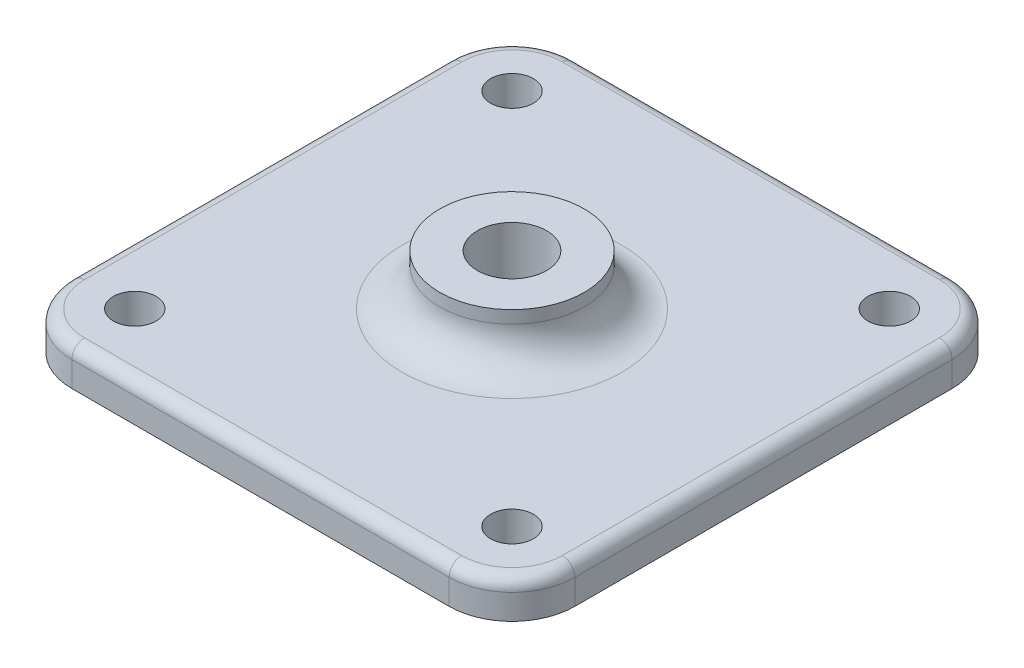
ISO-10303-21;
HEADER;
FILE_DESCRIPTION(('STEP AP214'),'2;1');
FILE_NAME('part.step','',(''),(''),'','','');
FILE_SCHEMA(('AUTOMOTIVE_DESIGN { 1 0 10303 214 1 1 1 1 }'));
ENDSEC;
DATA;
#1=APPLICATION_CONTEXT('core data for automotive mechanical design processes');
#2=APPLICATION_PROTOCOL_DEFINITION('international standard','automotive_design',2000,#1);
#3=PRODUCT_CONTEXT('',#1,'mechanical');
#4=PRODUCT('Part','Part','',(#3));
#5=PRODUCT_RELATED_PRODUCT_CATEGORY('part','',(#4));
#6=PRODUCT_DEFINITION_FORMATION('','',#4);
#7=PRODUCT_DEFINITION_CONTEXT('part definition',#1,'design');
#8=PRODUCT_DEFINITION('design','',#6,#7);
#9=PRODUCT_DEFINITION_SHAPE('','',#8);
#10=(LENGTH_UNIT() NAMED_UNIT(*) SI_UNIT(.MILLI.,.METRE.));
#11=(NAMED_UNIT(*) PLANE_ANGLE_UNIT() SI_UNIT($,.RADIAN.));
#12=(NAMED_UNIT(*) SI_UNIT($,.STERADIAN.) SOLID_ANGLE_UNIT());
#13=UNCERTAINTY_MEASURE_WITH_UNIT(LENGTH_MEASURE(1.E-05),#10,'distance_accuracy_value','');
#14=(GEOMETRIC_REPRESENTATION_CONTEXT(3) GLOBAL_UNCERTAINTY_ASSIGNED_CONTEXT((#13)) GLOBAL_UNIT_ASSIGNED_CONTEXT((#10,
#11,#12)) REPRESENTATION_CONTEXT('',''));
#15=CARTESIAN_POINT('',(0.,0.,0.));
#16=DIRECTION('',(0.,0.,1.));
#17=DIRECTION('',(1.,0.,0.));
#18=AXIS2_PLACEMENT_3D('',#15,#16,#17);
#19=CARTESIAN_POINT('',(0.,4.,0.));
#20=DIRECTION('',(0.,-1.,0.));
#21=DIRECTION('',(0.,0.,-1.));
#22=AXIS2_PLACEMENT_3D('',#19,#20,#21);
#23=CYLINDRICAL_SURFACE('',#22,2.75);
#24=CARTESIAN_POINT('',(0.,4.,0.));
#25=DIRECTION('',(0.,1.,0.));
#26=DIRECTION('',(0.,0.,1.));
#27=AXIS2_PLACEMENT_3D('',#24,#25,#26);
#28=CIRCLE('',#27,2.75);
#29=CARTESIAN_POINT('',(0.,4.,2.75));
#30=VERTEX_POINT('',#29);
#31=EDGE_CURVE('E195',#30,#30,#28,.T.);
#32=ORIENTED_EDGE('',*,*,#31,.T.);
#33=EDGE_LOOP('',(#32));
#34=FACE_BOUND('',#33,.T.);
#35=CARTESIAN_POINT('',(0.,-3.,0.));
#36=DIRECTION('',(0.,1.,0.));
#37=DIRECTION('',(0.,0.,1.));
#38=AXIS2_PLACEMENT_3D('',#35,#36,#37);
#39=CIRCLE('',#38,2.75);
#40=CARTESIAN_POINT('',(0.,-3.,2.75));
#41=VERTEX_POINT('',#40);
#42=EDGE_CURVE('E153',#41,#41,#39,.T.);
#43=ORIENTED_EDGE('',*,*,#42,.F.);
#44=EDGE_LOOP('',(#43));
#45=FACE_BOUND('',#44,.T.);
#46=ADVANCED_FACE('F35',(#34,#45),#23,.F.);
#47=CARTESIAN_POINT('',(0.,4.,0.));
#48=DIRECTION('',(0.,-1.,0.));
#49=DIRECTION('',(0.,0.,-1.));
#50=AXIS2_PLACEMENT_3D('',#47,#48,#49);
#51=CYLINDRICAL_SURFACE('',#50,5.75);
#52=CARTESIAN_POINT('',(0.,3.,0.));
#53=DIRECTION('',(0.,1.,0.));
#54=DIRECTION('',(0.,0.,1.));
#55=AXIS2_PLACEMENT_3D('',#52,#53,#54);
#56=CIRCLE('',#55,5.75);
#57=CARTESIAN_POINT('',(0.,3.,5.75));
#58=VERTEX_POINT('',#57);
#59=EDGE_CURVE('E215',#58,#58,#56,.T.);
#60=ORIENTED_EDGE('',*,*,#59,.T.);
#61=EDGE_LOOP('',(#60));
#62=FACE_BOUND('',#61,.T.);
#63=CARTESIAN_POINT('',(0.,4.,0.));
#64=DIRECTION('',(0.,1.,0.));
#65=DIRECTION('',(0.,0.,1.));
#66=AXIS2_PLACEMENT_3D('',#63,#64,#65);
#67=CIRCLE('',#66,5.75);
#68=CARTESIAN_POINT('',(0.,4.,5.75));
#69=VERTEX_POINT('',#68);
#70=EDGE_CURVE('E212',#69,#69,#67,.T.);
#71=ORIENTED_EDGE('',*,*,#70,.F.);
#72=EDGE_LOOP('',(#71));
#73=FACE_BOUND('',#72,.T.);
#74=ADVANCED_FACE('F325',(#62,#73),#51,.T.);
#75=CARTESIAN_POINT('',(0.,4.,0.));
#76=DIRECTION('',(0.,1.,0.));
#77=DIRECTION('',(0.,0.,1.));
#78=AXIS2_PLACEMENT_3D('',#75,#76,#77);
#79=PLANE('',#78);
#80=ORIENTED_EDGE('',*,*,#31,.F.);
#81=EDGE_LOOP('',(#80));
#82=FACE_BOUND('',#81,.T.);
#83=ORIENTED_EDGE('',*,*,#70,.T.);
#84=EDGE_LOOP('',(#83));
#85=FACE_BOUND('',#84,.T.);
#86=ADVANCED_FACE('F331',(#82,#85),#79,.T.);
#87=CARTESIAN_POINT('',(-15.,-3.,-15.));
#88=DIRECTION('',(0.,1.,0.));
#89=DIRECTION('',(0.,0.,1.));
#90=AXIS2_PLACEMENT_3D('',#87,#88,#89);
#91=CYLINDRICAL_SURFACE('',#90,5.);
#92=DIRECTION('',(0.,1.,0.));
#93=VECTOR('',#92,1.);
#94=CARTESIAN_POINT('',(-20.,-3.,-15.));
#95=LINE('',#94,#93);
#96=CARTESIAN_POINT('',(-20.,-3.,-15.));
#97=VERTEX_POINT('',#96);
#98=CARTESIAN_POINT('',(-20.,-1.,-15.));
#99=VERTEX_POINT('',#98);
#100=EDGE_CURVE('E141',#97,#99,#95,.T.);
#101=ORIENTED_EDGE('',*,*,#100,.T.);
#102=CARTESIAN_POINT('',(-15.,-1.,-15.));
#103=DIRECTION('',(0.,1.,0.));
#104=DIRECTION('',(0.,0.,1.));
#105=AXIS2_PLACEMENT_3D('',#102,#103,#104);
#106=CIRCLE('',#105,5.);
#107=CARTESIAN_POINT('',(-15.,-1.,-20.));
#108=VERTEX_POINT('',#107);
#109=EDGE_CURVE('E221',#99,#108,#106,.F.);
#110=ORIENTED_EDGE('',*,*,#109,.T.);
#111=DIRECTION('',(0.,1.,0.));
#112=VECTOR('',#111,1.);
#113=CARTESIAN_POINT('',(-15.,-3.,-20.));
#114=LINE('',#113,#112);
#115=CARTESIAN_POINT('',(-15.,-3.,-20.));
#116=VERTEX_POINT('',#115);
#117=EDGE_CURVE('E152',#116,#108,#114,.T.);
#118=ORIENTED_EDGE('',*,*,#117,.F.);
#119=CARTESIAN_POINT('',(-15.,-3.,-15.));
#120=DIRECTION('',(0.,1.,0.));
#121=DIRECTION('',(0.,0.,1.));
#122=AXIS2_PLACEMENT_3D('',#119,#120,#121);
#123=CIRCLE('',#122,5.);
#124=EDGE_CURVE('E131',#97,#116,#123,.F.);
#125=ORIENTED_EDGE('',*,*,#124,.F.);
#126=EDGE_LOOP('',(#101,#110,#118,#125));
#127=FACE_BOUND('',#126,.T.);
#128=ADVANCED_FACE('F151',(#127),#91,.T.);
#129=CARTESIAN_POINT('',(0.,-3.,-20.));
#130=DIRECTION('',(0.,0.,1.));
#131=DIRECTION('',(1.,0.,0.));
#132=AXIS2_PLACEMENT_3D('',#129,#130,#131);
#133=PLANE('',#132);
#134=ORIENTED_EDGE('',*,*,#117,.T.);
#135=DIRECTION('',(1.,0.,0.));
#136=VECTOR('',#135,1.);
#137=CARTESIAN_POINT('',(15.,-1.,-20.));
#138=LINE('',#137,#136);
#139=CARTESIAN_POINT('',(15.,-1.,-20.));
#140=VERTEX_POINT('',#139);
#141=EDGE_CURVE('E11',#108,#140,#138,.T.);
#142=ORIENTED_EDGE('',*,*,#141,.T.);
#143=DIRECTION('',(0.,1.,0.));
#144=VECTOR('',#143,1.);
#145=CARTESIAN_POINT('',(15.,-3.,-20.));
#146=LINE('',#145,#144);
#147=CARTESIAN_POINT('',(15.,-3.,-20.));
#148=VERTEX_POINT('',#147);
#149=EDGE_CURVE('E196',#148,#140,#146,.T.);
#150=ORIENTED_EDGE('',*,*,#149,.F.);
#151=DIRECTION('',(1.,0.,0.));
#152=VECTOR('',#151,1.);
#153=CARTESIAN_POINT('',(0.,-3.,-20.));
#154=LINE('',#153,#152);
#155=EDGE_CURVE('E170',#116,#148,#154,.T.);
#156=ORIENTED_EDGE('',*,*,#155,.F.);
#157=EDGE_LOOP('',(#134,#142,#150,#156));
#158=FACE_BOUND('',#157,.T.);
#159=ADVANCED_FACE('F298',(#158),#133,.F.);
#160=CARTESIAN_POINT('',(15.,-3.,-15.));
#161=DIRECTION('',(0.,1.,0.));
#162=DIRECTION('',(0.,0.,1.));
#163=AXIS2_PLACEMENT_3D('',#160,#161,#162);
#164=CYLINDRICAL_SURFACE('',#163,5.);
#165=ORIENTED_EDGE('',*,*,#149,.T.);
#166=CARTESIAN_POINT('',(15.,-1.,-15.));
#167=DIRECTION('',(0.,1.,0.));
#168=DIRECTION('',(0.,0.,1.));
#169=AXIS2_PLACEMENT_3D('',#166,#167,#168);
#170=CIRCLE('',#169,5.);
#171=CARTESIAN_POINT('',(20.,-1.,-15.));
#172=VERTEX_POINT('',#171);
#173=EDGE_CURVE('E44',#140,#172,#170,.F.);
#174=ORIENTED_EDGE('',*,*,#173,.T.);
#175=DIRECTION('',(0.,1.,0.));
#176=VECTOR('',#175,1.);
#177=CARTESIAN_POINT('',(20.,-3.,-15.));
#178=LINE('',#177,#176);
#179=CARTESIAN_POINT('',(20.,-3.,-15.));
#180=VERTEX_POINT('',#179);
#181=EDGE_CURVE('E198',#180,#172,#178,.T.);
#182=ORIENTED_EDGE('',*,*,#181,.F.);
#183=CARTESIAN_POINT('',(15.,-3.,-15.));
#184=DIRECTION('',(0.,1.,0.));
#185=DIRECTION('',(0.,0.,1.));
#186=AXIS2_PLACEMENT_3D('',#183,#184,#185);
#187=CIRCLE('',#186,5.);
#188=EDGE_CURVE('E168',#148,#180,#187,.F.);
#189=ORIENTED_EDGE('',*,*,#188,.F.);
#190=EDGE_LOOP('',(#165,#174,#182,#189));
#191=FACE_BOUND('',#190,.T.);
#192=ADVANCED_FACE('F301',(#191),#164,.T.);
#193=CARTESIAN_POINT('',(20.,-3.,0.));
#194=DIRECTION('',(1.,0.,0.));
#195=DIRECTION('',(0.,0.,-1.));
#196=AXIS2_PLACEMENT_3D('',#193,#194,#195);
#197=PLANE('',#196);
#198=ORIENTED_EDGE('',*,*,#181,.T.);
#199=DIRECTION('',(0.,0.,-1.));
#200=VECTOR('',#199,1.);
#201=CARTESIAN_POINT('',(20.,-1.,0.));
#202=LINE('',#201,#200);
#203=CARTESIAN_POINT('',(20.,-1.,15.));
#204=VERTEX_POINT('',#203);
#205=EDGE_CURVE('E247',#172,#204,#202,.F.);
#206=ORIENTED_EDGE('',*,*,#205,.T.);
#207=DIRECTION('',(0.,1.,0.));
#208=VECTOR('',#207,1.);
#209=CARTESIAN_POINT('',(20.,-3.,15.));
#210=LINE('',#209,#208);
#211=CARTESIAN_POINT('',(20.,-3.,15.));
#212=VERTEX_POINT('',#211);
#213=EDGE_CURVE('E200',#212,#204,#210,.T.);
#214=ORIENTED_EDGE('',*,*,#213,.F.);
#215=DIRECTION('',(0.,0.,-1.));
#216=VECTOR('',#215,1.);
#217=CARTESIAN_POINT('',(20.,-3.,0.));
#218=LINE('',#217,#216);
#219=EDGE_CURVE('E165',#212,#180,#218,.T.);
#220=ORIENTED_EDGE('',*,*,#219,.T.);
#221=EDGE_LOOP('',(#198,#206,#214,#220));
#222=FACE_BOUND('',#221,.T.);
#223=ADVANCED_FACE('F303',(#222),#197,.T.);
#224=CARTESIAN_POINT('',(15.,-3.,15.));
#225=DIRECTION('',(0.,1.,0.));
#226=DIRECTION('',(0.,0.,1.));
#227=AXIS2_PLACEMENT_3D('',#224,#225,#226);
#228=CYLINDRICAL_SURFACE('',#227,5.);
#229=ORIENTED_EDGE('',*,*,#213,.T.);
#230=CARTESIAN_POINT('',(15.,-1.,15.));
#231=DIRECTION('',(0.,1.,0.));
#232=DIRECTION('',(0.,0.,1.));
#233=AXIS2_PLACEMENT_3D('',#230,#231,#232);
#234=CIRCLE('',#233,5.);
#235=CARTESIAN_POINT('',(15.,-1.,20.));
#236=VERTEX_POINT('',#235);
#237=EDGE_CURVE('E245',#204,#236,#234,.F.);
#238=ORIENTED_EDGE('',*,*,#237,.T.);
#239=DIRECTION('',(0.,1.,0.));
#240=VECTOR('',#239,1.);
#241=CARTESIAN_POINT('',(15.,-3.,20.));
#242=LINE('',#241,#240);
#243=CARTESIAN_POINT('',(15.,-3.,20.));
#244=VERTEX_POINT('',#243);
#245=EDGE_CURVE('E203',#244,#236,#242,.T.);
#246=ORIENTED_EDGE('',*,*,#245,.F.);
#247=CARTESIAN_POINT('',(15.,-3.,15.));
#248=DIRECTION('',(0.,1.,0.));
#249=DIRECTION('',(0.,0.,1.));
#250=AXIS2_PLACEMENT_3D('',#247,#248,#249);
#251=CIRCLE('',#250,5.);
#252=EDGE_CURVE('E163',#212,#244,#251,.F.);
#253=ORIENTED_EDGE('',*,*,#252,.F.);
#254=EDGE_LOOP('',(#229,#238,#246,#253));
#255=FACE_BOUND('',#254,.T.);
#256=ADVANCED_FACE('F307',(#255),#228,.T.);
#257=CARTESIAN_POINT('',(0.,-3.,20.));
#258=DIRECTION('',(0.,0.,1.));
#259=DIRECTION('',(1.,0.,0.));
#260=AXIS2_PLACEMENT_3D('',#257,#258,#259);
#261=PLANE('',#260);
#262=ORIENTED_EDGE('',*,*,#245,.T.);
#263=DIRECTION('',(1.,0.,0.));
#264=VECTOR('',#263,1.);
#265=CARTESIAN_POINT('',(0.,-1.,20.));
#266=LINE('',#265,#264);
#267=CARTESIAN_POINT('',(-15.,-1.,20.));
#268=VERTEX_POINT('',#267);
#269=EDGE_CURVE('E243',#236,#268,#266,.F.);
#270=ORIENTED_EDGE('',*,*,#269,.T.);
#271=DIRECTION('',(0.,1.,0.));
#272=VECTOR('',#271,1.);
#273=CARTESIAN_POINT('',(-15.,-3.,20.));
#274=LINE('',#273,#272);
#275=CARTESIAN_POINT('',(-15.,-3.,20.));
#276=VERTEX_POINT('',#275);
#277=EDGE_CURVE('E206',#276,#268,#274,.T.);
#278=ORIENTED_EDGE('',*,*,#277,.F.);
#279=DIRECTION('',(1.,0.,0.));
#280=VECTOR('',#279,1.);
#281=CARTESIAN_POINT('',(0.,-3.,20.));
#282=LINE('',#281,#280);
#283=EDGE_CURVE('E160',#276,#244,#282,.T.);
#284=ORIENTED_EDGE('',*,*,#283,.T.);
#285=EDGE_LOOP('',(#262,#270,#278,#284));
#286=FACE_BOUND('',#285,.T.);
#287=ADVANCED_FACE('F309',(#286),#261,.T.);
#288=CARTESIAN_POINT('',(-15.,-3.,15.));
#289=DIRECTION('',(0.,1.,0.));
#290=DIRECTION('',(0.,0.,1.));
#291=AXIS2_PLACEMENT_3D('',#288,#289,#290);
#292=CYLINDRICAL_SURFACE('',#291,5.);
#293=ORIENTED_EDGE('',*,*,#277,.T.);
#294=CARTESIAN_POINT('',(-15.,-1.,15.));
#295=DIRECTION('',(0.,1.,0.));
#296=DIRECTION('',(0.,0.,1.));
#297=AXIS2_PLACEMENT_3D('',#294,#295,#296);
#298=CIRCLE('',#297,5.);
#299=CARTESIAN_POINT('',(-20.,-1.,15.));
#300=VERTEX_POINT('',#299);
#301=EDGE_CURVE('E241',#268,#300,#298,.F.);
#302=ORIENTED_EDGE('',*,*,#301,.T.);
#303=DIRECTION('',(0.,1.,0.));
#304=VECTOR('',#303,1.);
#305=CARTESIAN_POINT('',(-20.,-3.,15.));
#306=LINE('',#305,#304);
#307=CARTESIAN_POINT('',(-20.,-3.,15.));
#308=VERTEX_POINT('',#307);
#309=EDGE_CURVE('E148',#308,#300,#306,.T.);
#310=ORIENTED_EDGE('',*,*,#309,.F.);
#311=CARTESIAN_POINT('',(-15.,-3.,15.));
#312=DIRECTION('',(0.,1.,0.));
#313=DIRECTION('',(0.,0.,1.));
#314=AXIS2_PLACEMENT_3D('',#311,#312,#313);
#315=CIRCLE('',#314,5.);
#316=EDGE_CURVE('E135',#276,#308,#315,.F.);
#317=ORIENTED_EDGE('',*,*,#316,.F.);
#318=EDGE_LOOP('',(#293,#302,#310,#317));
#319=FACE_BOUND('',#318,.T.);
#320=ADVANCED_FACE('F311',(#319),#292,.T.);
#321=CARTESIAN_POINT('',(-15.,-3.,-15.));
#322=DIRECTION('',(0.,1.,0.));
#323=DIRECTION('',(0.,0.,1.));
#324=AXIS2_PLACEMENT_3D('',#321,#322,#323);
#325=CYLINDRICAL_SURFACE('',#324,1.7);
#326=CARTESIAN_POINT('',(-15.,-3.,-15.));
#327=DIRECTION('',(0.,1.,0.));
#328=DIRECTION('',(0.,0.,1.));
#329=AXIS2_PLACEMENT_3D('',#326,#327,#328);
#330=CIRCLE('',#329,1.7);
#331=CARTESIAN_POINT('',(-15.,-3.,-13.3));
#332=VERTEX_POINT('',#331);
#333=EDGE_CURVE('E178',#332,#332,#330,.T.);
#334=ORIENTED_EDGE('',*,*,#333,.F.);
#335=EDGE_LOOP('',(#334));
#336=FACE_BOUND('',#335,.T.);
#337=CARTESIAN_POINT('',(-15.,0.,-15.));
#338=DIRECTION('',(0.,1.,0.));
#339=DIRECTION('',(0.,0.,1.));
#340=AXIS2_PLACEMENT_3D('',#337,#338,#339);
#341=CIRCLE('',#340,1.7);
#342=CARTESIAN_POINT('',(-15.,0.,-13.3));
#343=VERTEX_POINT('',#342);
#344=EDGE_CURVE('E189',#343,#343,#341,.T.);
#345=ORIENTED_EDGE('',*,*,#344,.T.);
#346=EDGE_LOOP('',(#345));
#347=FACE_BOUND('',#346,.T.);
#348=ADVANCED_FACE('F313',(#336,#347),#325,.F.);
#349=CARTESIAN_POINT('',(15.,-3.,-15.));
#350=DIRECTION('',(0.,1.,0.));
#351=DIRECTION('',(0.,0.,1.));
#352=AXIS2_PLACEMENT_3D('',#349,#350,#351);
#353=CYLINDRICAL_SURFACE('',#352,1.7);
#354=CARTESIAN_POINT('',(15.,-3.,-15.));
#355=DIRECTION('',(0.,1.,0.));
#356=DIRECTION('',(0.,0.,1.));
#357=AXIS2_PLACEMENT_3D('',#354,#355,#356);
#358=CIRCLE('',#357,1.7);
#359=CARTESIAN_POINT('',(15.,-3.,-13.3));
#360=VERTEX_POINT('',#359);
#361=EDGE_CURVE('E175',#360,#360,#358,.T.);
#362=ORIENTED_EDGE('',*,*,#361,.F.);
#363=EDGE_LOOP('',(#362));
#364=FACE_BOUND('',#363,.T.);
#365=CARTESIAN_POINT('',(15.,0.,-15.));
#366=DIRECTION('',(0.,1.,0.));
#367=DIRECTION('',(0.,0.,1.));
#368=AXIS2_PLACEMENT_3D('',#365,#366,#367);
#369=CIRCLE('',#368,1.7);
#370=CARTESIAN_POINT('',(15.,0.,-13.3));
#371=VERTEX_POINT('',#370);
#372=EDGE_CURVE('E186',#371,#371,#369,.T.);
#373=ORIENTED_EDGE('',*,*,#372,.T.);
#374=EDGE_LOOP('',(#373));
#375=FACE_BOUND('',#374,.T.);
#376=ADVANCED_FACE('F319',(#364,#375),#353,.F.);
#377=CARTESIAN_POINT('',(15.,-3.,15.));
#378=DIRECTION('',(0.,1.,0.));
#379=DIRECTION('',(0.,0.,1.));
#380=AXIS2_PLACEMENT_3D('',#377,#378,#379);
#381=CYLINDRICAL_SURFACE('',#380,1.7);
#382=CARTESIAN_POINT('',(15.,-3.,15.));
#383=DIRECTION('',(0.,1.,0.));
#384=DIRECTION('',(0.,0.,1.));
#385=AXIS2_PLACEMENT_3D('',#382,#383,#384);
#386=CIRCLE('',#385,1.7);
#387=CARTESIAN_POINT('',(15.,-3.,16.7));
#388=VERTEX_POINT('',#387);
#389=EDGE_CURVE('E172',#388,#388,#386,.F.);
#390=ORIENTED_EDGE('',*,*,#389,.T.);
#391=EDGE_LOOP('',(#390));
#392=FACE_BOUND('',#391,.T.);
#393=CARTESIAN_POINT('',(15.,0.,15.));
#394=DIRECTION('',(0.,1.,0.));
#395=DIRECTION('',(0.,0.,1.));
#396=AXIS2_PLACEMENT_3D('',#393,#394,#395);
#397=CIRCLE('',#396,1.7);
#398=CARTESIAN_POINT('',(15.,0.,16.7));
#399=VERTEX_POINT('',#398);
#400=EDGE_CURVE('E183',#399,#399,#397,.F.);
#401=ORIENTED_EDGE('',*,*,#400,.F.);
#402=EDGE_LOOP('',(#401));
#403=FACE_BOUND('',#402,.T.);
#404=ADVANCED_FACE('F397',(#392,#403),#381,.F.);
#405=CARTESIAN_POINT('',(-20.,-3.,0.));
#406=DIRECTION('',(1.,0.,0.));
#407=DIRECTION('',(0.,0.,-1.));
#408=AXIS2_PLACEMENT_3D('',#405,#406,#407);
#409=PLANE('',#408);
#410=ORIENTED_EDGE('',*,*,#309,.T.);
#411=DIRECTION('',(0.,0.,-1.));
#412=VECTOR('',#411,1.);
#413=CARTESIAN_POINT('',(-20.,-1.,-15.));
#414=LINE('',#413,#412);
#415=EDGE_CURVE('E144',#300,#99,#414,.T.);
#416=ORIENTED_EDGE('',*,*,#415,.T.);
#417=ORIENTED_EDGE('',*,*,#100,.F.);
#418=DIRECTION('',(0.,0.,-1.));
#419=VECTOR('',#418,1.);
#420=CARTESIAN_POINT('',(-20.,-3.,0.));
#421=LINE('',#420,#419);
#422=EDGE_CURVE('E126',#308,#97,#421,.T.);
#423=ORIENTED_EDGE('',*,*,#422,.F.);
#424=EDGE_LOOP('',(#410,#416,#417,#423));
#425=FACE_BOUND('',#424,.T.);
#426=ADVANCED_FACE('F142',(#425),#409,.F.);
#427=CARTESIAN_POINT('',(-15.,-3.,15.));
#428=DIRECTION('',(0.,1.,0.));
#429=DIRECTION('',(0.,0.,1.));
#430=AXIS2_PLACEMENT_3D('',#427,#428,#429);
#431=CYLINDRICAL_SURFACE('',#430,1.7);
#432=CARTESIAN_POINT('',(-15.,-3.,15.));
#433=DIRECTION('',(0.,1.,0.));
#434=DIRECTION('',(0.,0.,1.));
#435=AXIS2_PLACEMENT_3D('',#432,#433,#434);
#436=CIRCLE('',#435,1.7);
#437=CARTESIAN_POINT('',(-15.,-3.,16.7));
#438=VERTEX_POINT('',#437);
#439=EDGE_CURVE('E149',#438,#438,#436,.F.);
#440=ORIENTED_EDGE('',*,*,#439,.T.);
#441=EDGE_LOOP('',(#440));
#442=FACE_BOUND('',#441,.T.);
#443=CARTESIAN_POINT('',(-15.,0.,15.));
#444=DIRECTION('',(0.,1.,0.));
#445=DIRECTION('',(0.,0.,1.));
#446=AXIS2_PLACEMENT_3D('',#443,#444,#445);
#447=CIRCLE('',#446,1.7);
#448=CARTESIAN_POINT('',(-15.,0.,16.7));
#449=VERTEX_POINT('',#448);
#450=EDGE_CURVE('E156',#449,#449,#447,.F.);
#451=ORIENTED_EDGE('',*,*,#450,.F.);
#452=EDGE_LOOP('',(#451));
#453=FACE_BOUND('',#452,.T.);
#454=ADVANCED_FACE('F382',(#442,#453),#431,.F.);
#455=CARTESIAN_POINT('',(0.,-3.,0.));
#456=DIRECTION('',(0.,1.,0.));
#457=DIRECTION('',(0.,0.,1.));
#458=AXIS2_PLACEMENT_3D('',#455,#456,#457);
#459=PLANE('',#458);
#460=ORIENTED_EDGE('',*,*,#42,.T.);
#461=EDGE_LOOP('',(#460));
#462=FACE_BOUND('',#461,.T.);
#463=ORIENTED_EDGE('',*,*,#124,.T.);
#464=ORIENTED_EDGE('',*,*,#155,.T.);
#465=ORIENTED_EDGE('',*,*,#188,.T.);
#466=ORIENTED_EDGE('',*,*,#219,.F.);
#467=ORIENTED_EDGE('',*,*,#252,.T.);
#468=ORIENTED_EDGE('',*,*,#283,.F.);
#469=ORIENTED_EDGE('',*,*,#316,.T.);
#470=ORIENTED_EDGE('',*,*,#422,.T.);
#471=EDGE_LOOP('',(#463,#464,#465,#466,#467,#468,#469,#470));
#472=FACE_BOUND('',#471,.T.);
#473=ORIENTED_EDGE('',*,*,#389,.F.);
#474=EDGE_LOOP('',(#473));
#475=FACE_BOUND('',#474,.T.);
#476=ORIENTED_EDGE('',*,*,#361,.T.);
#477=EDGE_LOOP('',(#476));
#478=FACE_BOUND('',#477,.T.);
#479=ORIENTED_EDGE('',*,*,#333,.T.);
#480=EDGE_LOOP('',(#479));
#481=FACE_BOUND('',#480,.T.);
#482=ORIENTED_EDGE('',*,*,#439,.F.);
#483=EDGE_LOOP('',(#482));
#484=FACE_BOUND('',#483,.T.);
#485=ADVANCED_FACE('F128',(#462,#472,#475,#478,#481,#484),#459,.F.);
#486=CARTESIAN_POINT('',(0.,0.,0.));
#487=DIRECTION('',(0.,1.,0.));
#488=DIRECTION('',(0.,0.,1.));
#489=AXIS2_PLACEMENT_3D('',#486,#487,#488);
#490=PLANE('',#489);
#491=DIRECTION('',(1.,0.,0.));
#492=VECTOR('',#491,1.);
#493=CARTESIAN_POINT('',(-15.,0.,-19.));
#494=LINE('',#493,#492);
#495=CARTESIAN_POINT('',(15.,0.,-19.));
#496=VERTEX_POINT('',#495);
#497=CARTESIAN_POINT('',(-15.,0.,-19.));
#498=VERTEX_POINT('',#497);
#499=EDGE_CURVE('E223',#496,#498,#494,.F.);
#500=ORIENTED_EDGE('',*,*,#499,.T.);
#501=CARTESIAN_POINT('',(-15.,0.,-15.));
#502=DIRECTION('',(0.,1.,0.));
#503=DIRECTION('',(0.,0.,1.));
#504=AXIS2_PLACEMENT_3D('',#501,#502,#503);
#505=CIRCLE('',#504,4.);
#506=CARTESIAN_POINT('',(-19.,0.,-15.));
#507=VERTEX_POINT('',#506);
#508=EDGE_CURVE('E237',#498,#507,#505,.T.);
#509=ORIENTED_EDGE('',*,*,#508,.T.);
#510=DIRECTION('',(0.,0.,-1.));
#511=VECTOR('',#510,1.);
#512=CARTESIAN_POINT('',(-19.,0.,15.));
#513=LINE('',#512,#511);
#514=CARTESIAN_POINT('',(-19.,0.,15.));
#515=VERTEX_POINT('',#514);
#516=EDGE_CURVE('E235',#507,#515,#513,.F.);
#517=ORIENTED_EDGE('',*,*,#516,.T.);
#518=CARTESIAN_POINT('',(-15.,0.,15.));
#519=DIRECTION('',(0.,1.,0.));
#520=DIRECTION('',(0.,0.,1.));
#521=AXIS2_PLACEMENT_3D('',#518,#519,#520);
#522=CIRCLE('',#521,4.);
#523=CARTESIAN_POINT('',(-15.,0.,19.));
#524=VERTEX_POINT('',#523);
#525=EDGE_CURVE('E233',#515,#524,#522,.T.);
#526=ORIENTED_EDGE('',*,*,#525,.T.);
#527=DIRECTION('',(1.,0.,0.));
#528=VECTOR('',#527,1.);
#529=CARTESIAN_POINT('',(0.,0.,19.));
#530=LINE('',#529,#528);
#531=CARTESIAN_POINT('',(15.,0.,19.));
#532=VERTEX_POINT('',#531);
#533=EDGE_CURVE('E231',#524,#532,#530,.T.);
#534=ORIENTED_EDGE('',*,*,#533,.T.);
#535=CARTESIAN_POINT('',(15.,0.,15.));
#536=DIRECTION('',(0.,1.,0.));
#537=DIRECTION('',(0.,0.,1.));
#538=AXIS2_PLACEMENT_3D('',#535,#536,#537);
#539=CIRCLE('',#538,4.);
#540=CARTESIAN_POINT('',(19.,0.,15.));
#541=VERTEX_POINT('',#540);
#542=EDGE_CURVE('E229',#532,#541,#539,.T.);
#543=ORIENTED_EDGE('',*,*,#542,.T.);
#544=DIRECTION('',(0.,0.,-1.));
#545=VECTOR('',#544,1.);
#546=CARTESIAN_POINT('',(19.,0.,0.));
#547=LINE('',#546,#545);
#548=CARTESIAN_POINT('',(19.,0.,-15.));
#549=VERTEX_POINT('',#548);
#550=EDGE_CURVE('E227',#541,#549,#547,.T.);
#551=ORIENTED_EDGE('',*,*,#550,.T.);
#552=CARTESIAN_POINT('',(15.,0.,-15.));
#553=DIRECTION('',(0.,1.,0.));
#554=DIRECTION('',(0.,0.,1.));
#555=AXIS2_PLACEMENT_3D('',#552,#553,#554);
#556=CIRCLE('',#555,4.);
#557=EDGE_CURVE('E225',#549,#496,#556,.T.);
#558=ORIENTED_EDGE('',*,*,#557,.T.);
#559=EDGE_LOOP('',(#500,#509,#517,#526,#534,#543,#551,#558));
#560=FACE_BOUND('',#559,.T.);
#561=CARTESIAN_POINT('',(0.,0.,0.));
#562=DIRECTION('',(0.,1.,0.));
#563=DIRECTION('',(0.,0.,1.));
#564=AXIS2_PLACEMENT_3D('',#561,#562,#563);
#565=CIRCLE('',#564,8.75);
#566=CARTESIAN_POINT('',(0.,0.,8.75));
#567=VERTEX_POINT('',#566);
#568=EDGE_CURVE('E218',#567,#567,#565,.F.);
#569=ORIENTED_EDGE('',*,*,#568,.T.);
#570=EDGE_LOOP('',(#569));
#571=FACE_BOUND('',#570,.T.);
#572=ORIENTED_EDGE('',*,*,#400,.T.);
#573=EDGE_LOOP('',(#572));
#574=FACE_BOUND('',#573,.T.);
#575=ORIENTED_EDGE('',*,*,#372,.F.);
#576=EDGE_LOOP('',(#575));
#577=FACE_BOUND('',#576,.T.);
#578=ORIENTED_EDGE('',*,*,#344,.F.);
#579=EDGE_LOOP('',(#578));
#580=FACE_BOUND('',#579,.T.);
#581=ORIENTED_EDGE('',*,*,#450,.T.);
#582=EDGE_LOOP('',(#581));
#583=FACE_BOUND('',#582,.T.);
#584=ADVANCED_FACE('F282',(#560,#571,#574,#577,#580,#583),#490,.T.);
#585=CARTESIAN_POINT('',(0.,3.,0.));
#586=DIRECTION('',(0.,1.,0.));
#587=DIRECTION('',(0.,0.,1.));
#588=AXIS2_PLACEMENT_3D('',#585,#586,#587);
#589=TOROIDAL_SURFACE('',#588,8.75,3.);
#590=ORIENTED_EDGE('',*,*,#568,.F.);
#591=EDGE_LOOP('',(#590));
#592=FACE_BOUND('',#591,.T.);
#593=ORIENTED_EDGE('',*,*,#59,.F.);
#594=EDGE_LOOP('',(#593));
#595=FACE_BOUND('',#594,.T.);
#596=ADVANCED_FACE('F337',(#592,#595),#589,.F.);
#597=CARTESIAN_POINT('',(15.,-1.,15.));
#598=DIRECTION('',(0.,1.,0.));
#599=DIRECTION('',(0.,0.,1.));
#600=AXIS2_PLACEMENT_3D('',#597,#598,#599);
#601=TOROIDAL_SURFACE('',#600,4.,1.);
#602=CARTESIAN_POINT('',(19.,-1.,15.));
#603=DIRECTION('',(0.,0.,-1.));
#604=DIRECTION('',(-1.,0.,0.));
#605=AXIS2_PLACEMENT_3D('',#602,#603,#604);
#606=CIRCLE('',#605,1.);
#607=EDGE_CURVE('E265',#541,#204,#606,.T.);
#608=ORIENTED_EDGE('',*,*,#607,.F.);
#609=ORIENTED_EDGE('',*,*,#542,.F.);
#610=CARTESIAN_POINT('',(15.,-1.,19.));
#611=DIRECTION('',(-1.,0.,0.));
#612=DIRECTION('',(0.,-1.,0.));
#613=AXIS2_PLACEMENT_3D('',#610,#611,#612);
#614=CIRCLE('',#613,1.);
#615=EDGE_CURVE('E39',#236,#532,#614,.T.);
#616=ORIENTED_EDGE('',*,*,#615,.F.);
#617=ORIENTED_EDGE('',*,*,#237,.F.);
#618=EDGE_LOOP('',(#608,#609,#616,#617));
#619=FACE_BOUND('',#618,.T.);
#620=ADVANCED_FACE('F37',(#619),#601,.T.);
#621=CARTESIAN_POINT('',(0.,-1.,19.));
#622=DIRECTION('',(1.,0.,0.));
#623=DIRECTION('',(0.,0.,-1.));
#624=AXIS2_PLACEMENT_3D('',#621,#622,#623);
#625=CYLINDRICAL_SURFACE('',#624,1.);
#626=ORIENTED_EDGE('',*,*,#615,.T.);
#627=ORIENTED_EDGE('',*,*,#533,.F.);
#628=CARTESIAN_POINT('',(-15.,-1.,19.));
#629=DIRECTION('',(-1.,0.,0.));
#630=DIRECTION('',(0.,-1.,0.));
#631=AXIS2_PLACEMENT_3D('',#628,#629,#630);
#632=CIRCLE('',#631,1.);
#633=EDGE_CURVE('E263',#268,#524,#632,.T.);
#634=ORIENTED_EDGE('',*,*,#633,.F.);
#635=ORIENTED_EDGE('',*,*,#269,.F.);
#636=EDGE_LOOP('',(#626,#627,#634,#635));
#637=FACE_BOUND('',#636,.T.);
#638=ADVANCED_FACE('F276',(#637),#625,.T.);
#639=CARTESIAN_POINT('',(19.,-1.,0.));
#640=DIRECTION('',(0.,0.,-1.));
#641=DIRECTION('',(-1.,0.,0.));
#642=AXIS2_PLACEMENT_3D('',#639,#640,#641);
#643=CYLINDRICAL_SURFACE('',#642,1.);
#644=ORIENTED_EDGE('',*,*,#607,.T.);
#645=ORIENTED_EDGE('',*,*,#205,.F.);
#646=CARTESIAN_POINT('',(19.,-1.,-15.));
#647=DIRECTION('',(0.,0.,-1.));
#648=DIRECTION('',(-1.,0.,0.));
#649=AXIS2_PLACEMENT_3D('',#646,#647,#648);
#650=CIRCLE('',#649,1.);
#651=EDGE_CURVE('E260',#549,#172,#650,.T.);
#652=ORIENTED_EDGE('',*,*,#651,.F.);
#653=ORIENTED_EDGE('',*,*,#550,.F.);
#654=EDGE_LOOP('',(#644,#645,#652,#653));
#655=FACE_BOUND('',#654,.T.);
#656=ADVANCED_FACE('F355',(#655),#643,.T.);
#657=CARTESIAN_POINT('',(-15.,-1.,15.));
#658=DIRECTION('',(0.,1.,0.));
#659=DIRECTION('',(0.,0.,1.));
#660=AXIS2_PLACEMENT_3D('',#657,#658,#659);
#661=TOROIDAL_SURFACE('',#660,4.,1.);
#662=ORIENTED_EDGE('',*,*,#633,.T.);
#663=ORIENTED_EDGE('',*,*,#525,.F.);
#664=CARTESIAN_POINT('',(-19.,-1.,15.));
#665=DIRECTION('',(0.,0.,-1.));
#666=DIRECTION('',(0.,1.,0.));
#667=AXIS2_PLACEMENT_3D('',#664,#665,#666);
#668=CIRCLE('',#667,1.);
#669=EDGE_CURVE('E257',#300,#515,#668,.T.);
#670=ORIENTED_EDGE('',*,*,#669,.F.);
#671=ORIENTED_EDGE('',*,*,#301,.F.);
#672=EDGE_LOOP('',(#662,#663,#670,#671));
#673=FACE_BOUND('',#672,.T.);
#674=ADVANCED_FACE('F289',(#673),#661,.T.);
#675=CARTESIAN_POINT('',(15.,-1.,-15.));
#676=DIRECTION('',(0.,1.,0.));
#677=DIRECTION('',(0.,0.,1.));
#678=AXIS2_PLACEMENT_3D('',#675,#676,#677);
#679=TOROIDAL_SURFACE('',#678,4.,1.);
#680=ORIENTED_EDGE('',*,*,#651,.T.);
#681=ORIENTED_EDGE('',*,*,#173,.F.);
#682=CARTESIAN_POINT('',(15.,-1.,-19.));
#683=DIRECTION('',(-1.,0.,0.));
#684=DIRECTION('',(0.,0.,1.));
#685=AXIS2_PLACEMENT_3D('',#682,#683,#684);
#686=CIRCLE('',#685,1.);
#687=EDGE_CURVE('E254',#496,#140,#686,.T.);
#688=ORIENTED_EDGE('',*,*,#687,.F.);
#689=ORIENTED_EDGE('',*,*,#557,.F.);
#690=EDGE_LOOP('',(#680,#681,#688,#689));
#691=FACE_BOUND('',#690,.T.);
#692=ADVANCED_FACE('F349',(#691),#679,.T.);
#693=CARTESIAN_POINT('',(-19.,-1.,0.));
#694=DIRECTION('',(0.,0.,1.));
#695=DIRECTION('',(1.,0.,0.));
#696=AXIS2_PLACEMENT_3D('',#693,#694,#695);
#697=CYLINDRICAL_SURFACE('',#696,1.);
#698=ORIENTED_EDGE('',*,*,#669,.T.);
#699=ORIENTED_EDGE('',*,*,#516,.F.);
#700=CARTESIAN_POINT('',(-19.,-1.,-15.));
#701=DIRECTION('',(0.,0.,-1.));
#702=DIRECTION('',(0.,1.,0.));
#703=AXIS2_PLACEMENT_3D('',#700,#701,#702);
#704=CIRCLE('',#703,1.);
#705=EDGE_CURVE('E252',#99,#507,#704,.T.);
#706=ORIENTED_EDGE('',*,*,#705,.F.);
#707=ORIENTED_EDGE('',*,*,#415,.F.);
#708=EDGE_LOOP('',(#698,#699,#706,#707));
#709=FACE_BOUND('',#708,.T.);
#710=ADVANCED_FACE('F292',(#709),#697,.T.);
#711=CARTESIAN_POINT('',(0.,-1.,-19.));
#712=DIRECTION('',(-1.,0.,0.));
#713=DIRECTION('',(0.,0.,1.));
#714=AXIS2_PLACEMENT_3D('',#711,#712,#713);
#715=CYLINDRICAL_SURFACE('',#714,1.);
#716=ORIENTED_EDGE('',*,*,#687,.T.);
#717=ORIENTED_EDGE('',*,*,#141,.F.);
#718=CARTESIAN_POINT('',(-15.,-1.,-19.));
#719=DIRECTION('',(-1.,0.,0.));
#720=DIRECTION('',(0.,0.,1.));
#721=AXIS2_PLACEMENT_3D('',#718,#719,#720);
#722=CIRCLE('',#721,1.);
#723=EDGE_CURVE('E250',#498,#108,#722,.T.);
#724=ORIENTED_EDGE('',*,*,#723,.F.);
#725=ORIENTED_EDGE('',*,*,#499,.F.);
#726=EDGE_LOOP('',(#716,#717,#724,#725));
#727=FACE_BOUND('',#726,.T.);
#728=ADVANCED_FACE('F343',(#727),#715,.T.);
#729=CARTESIAN_POINT('',(-15.,-1.,-15.));
#730=DIRECTION('',(0.,1.,0.));
#731=DIRECTION('',(0.,0.,1.));
#732=AXIS2_PLACEMENT_3D('',#729,#730,#731);
#733=TOROIDAL_SURFACE('',#732,4.,1.);
#734=ORIENTED_EDGE('',*,*,#705,.T.);
#735=ORIENTED_EDGE('',*,*,#508,.F.);
#736=ORIENTED_EDGE('',*,*,#723,.T.);
#737=ORIENTED_EDGE('',*,*,#109,.F.);
#738=EDGE_LOOP('',(#734,#735,#736,#737));
#739=FACE_BOUND('',#738,.T.);
#740=ADVANCED_FACE('F296',(#739),#733,.T.);
#741=CLOSED_SHELL('',(#46,#74,#86,#128,#159,#192,#223,#256,#287,#320,#348,#376,#404,#426,#454,
#485,#584,#596,#620,#638,#656,#674,#692,#710,#728,#740));
#742=MANIFOLD_SOLID_BREP('B2',#741);
#743=ADVANCED_BREP_SHAPE_REPRESENTATION('',(#18,#742),#14);
#744=SHAPE_DEFINITION_REPRESENTATION(#9,#743);
ENDSEC;
END-ISO-10303-21;
